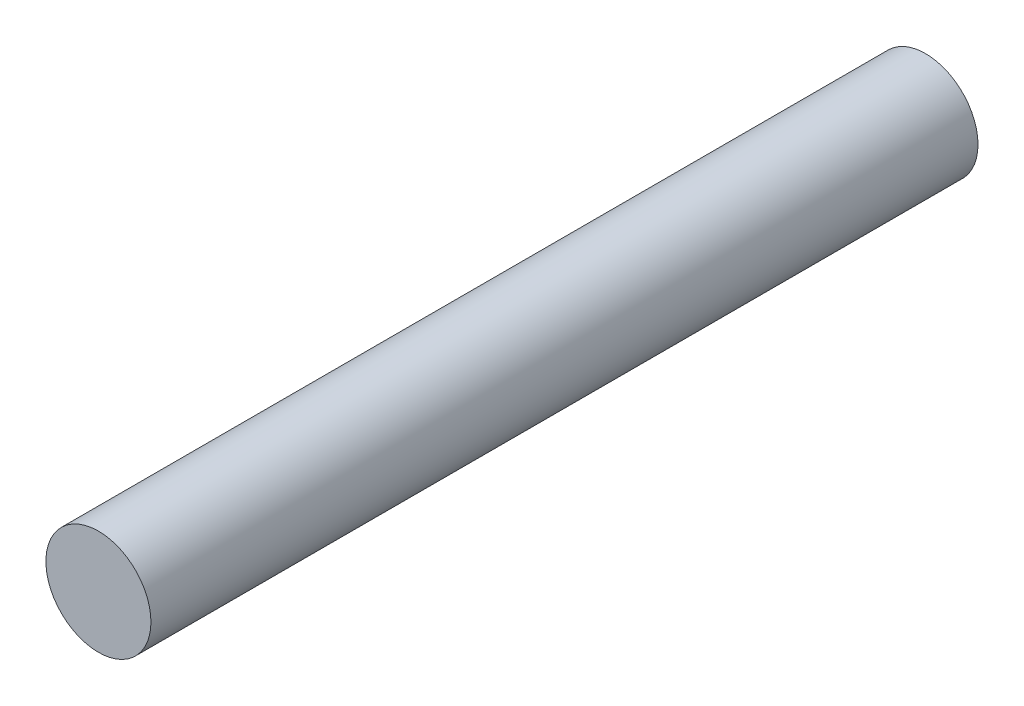
ISO-10303-21;
HEADER;
FILE_DESCRIPTION(('STEP AP214'),'2;1');
FILE_NAME('part.step','',(''),(''),'','','');
FILE_SCHEMA(('AUTOMOTIVE_DESIGN { 1 0 10303 214 1 1 1 1 }'));
ENDSEC;
DATA;
#1=APPLICATION_CONTEXT('core data for automotive mechanical design processes');
#2=APPLICATION_PROTOCOL_DEFINITION('international standard','automotive_design',2000,#1);
#3=PRODUCT_CONTEXT('',#1,'mechanical');
#4=PRODUCT('Part','Part','',(#3));
#5=PRODUCT_RELATED_PRODUCT_CATEGORY('part','',(#4));
#6=PRODUCT_DEFINITION_FORMATION('','',#4);
#7=PRODUCT_DEFINITION_CONTEXT('part definition',#1,'design');
#8=PRODUCT_DEFINITION('design','',#6,#7);
#9=PRODUCT_DEFINITION_SHAPE('','',#8);
#10=(LENGTH_UNIT() NAMED_UNIT(*) SI_UNIT(.MILLI.,.METRE.));
#11=(NAMED_UNIT(*) PLANE_ANGLE_UNIT() SI_UNIT($,.RADIAN.));
#12=(NAMED_UNIT(*) SI_UNIT($,.STERADIAN.) SOLID_ANGLE_UNIT());
#13=UNCERTAINTY_MEASURE_WITH_UNIT(LENGTH_MEASURE(1.E-05),#10,'distance_accuracy_value','');
#14=(GEOMETRIC_REPRESENTATION_CONTEXT(3) GLOBAL_UNCERTAINTY_ASSIGNED_CONTEXT((#13)) GLOBAL_UNIT_ASSIGNED_CONTEXT((#10,
#11,#12)) REPRESENTATION_CONTEXT('',''));
#15=CARTESIAN_POINT('',(0.,0.,0.));
#16=DIRECTION('',(0.,0.,1.));
#17=DIRECTION('',(1.,0.,0.));
#18=AXIS2_PLACEMENT_3D('',#15,#16,#17);
#19=CARTESIAN_POINT('',(0.,0.,-100.));
#20=DIRECTION('',(0.,0.,1.));
#21=DIRECTION('',(1.,0.,0.));
#22=AXIS2_PLACEMENT_3D('',#19,#20,#21);
#23=CYLINDRICAL_SURFACE('',#22,6.35);
#24=CARTESIAN_POINT('',(0.,0.,-100.));
#25=DIRECTION('',(0.,0.,1.));
#26=DIRECTION('',(1.,0.,0.));
#27=AXIS2_PLACEMENT_3D('',#24,#25,#26);
#28=CIRCLE('',#27,6.35);
#29=CARTESIAN_POINT('',(6.35,0.,-100.));
#30=VERTEX_POINT('',#29);
#31=EDGE_CURVE('E10',#30,#30,#28,.T.);
#32=ORIENTED_EDGE('',*,*,#31,.T.);
#33=EDGE_LOOP('',(#32));
#34=FACE_BOUND('',#33,.T.);
#35=CARTESIAN_POINT('',(0.,0.,0.));
#36=DIRECTION('',(0.,0.,1.));
#37=DIRECTION('',(1.,0.,0.));
#38=AXIS2_PLACEMENT_3D('',#35,#36,#37);
#39=CIRCLE('',#38,6.35);
#40=CARTESIAN_POINT('',(6.35,0.,0.));
#41=VERTEX_POINT('',#40);
#42=EDGE_CURVE('E34',#41,#41,#39,.T.);
#43=ORIENTED_EDGE('',*,*,#42,.F.);
#44=EDGE_LOOP('',(#43));
#45=FACE_BOUND('',#44,.T.);
#46=ADVANCED_FACE('F31',(#34,#45),#23,.T.);
#47=CARTESIAN_POINT('',(0.,0.,-100.));
#48=DIRECTION('',(0.,0.,1.));
#49=DIRECTION('',(1.,0.,0.));
#50=AXIS2_PLACEMENT_3D('',#47,#48,#49);
#51=PLANE('',#50);
#52=ORIENTED_EDGE('',*,*,#31,.F.);
#53=EDGE_LOOP('',(#52));
#54=FACE_BOUND('',#53,.T.);
#55=ADVANCED_FACE('F46',(#54),#51,.F.);
#56=CARTESIAN_POINT('',(0.,0.,0.));
#57=DIRECTION('',(0.,0.,1.));
#58=DIRECTION('',(1.,0.,0.));
#59=AXIS2_PLACEMENT_3D('',#56,#57,#58);
#60=PLANE('',#59);
#61=ORIENTED_EDGE('',*,*,#42,.T.);
#62=EDGE_LOOP('',(#61));
#63=FACE_BOUND('',#62,.T.);
#64=ADVANCED_FACE('F43',(#63),#60,.T.);
#65=CLOSED_SHELL('',(#46,#55,#64));
#66=MANIFOLD_SOLID_BREP('B2',#65);
#67=ADVANCED_BREP_SHAPE_REPRESENTATION('',(#18,#66),#14);
#68=SHAPE_DEFINITION_REPRESENTATION(#9,#67);
ENDSEC;
END-ISO-10303-21;
